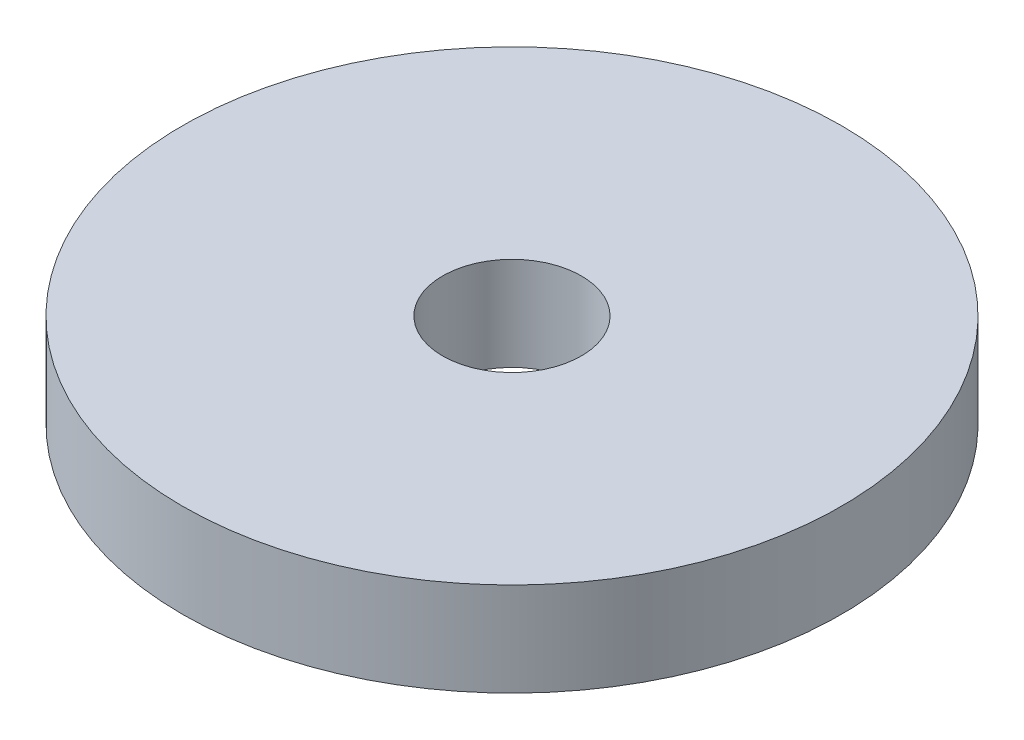
ISO-10303-21;
HEADER;
FILE_DESCRIPTION(('STEP AP214'),'2;1');
FILE_NAME('part.step','',(''),(''),'','','');
FILE_SCHEMA(('AUTOMOTIVE_DESIGN { 1 0 10303 214 1 1 1 1 }'));
ENDSEC;
DATA;
#1=APPLICATION_CONTEXT('core data for automotive mechanical design processes');
#2=APPLICATION_PROTOCOL_DEFINITION('international standard','automotive_design',2000,#1);
#3=PRODUCT_CONTEXT('',#1,'mechanical');
#4=PRODUCT('Part','Part','',(#3));
#5=PRODUCT_RELATED_PRODUCT_CATEGORY('part','',(#4));
#6=PRODUCT_DEFINITION_FORMATION('','',#4);
#7=PRODUCT_DEFINITION_CONTEXT('part definition',#1,'design');
#8=PRODUCT_DEFINITION('design','',#6,#7);
#9=PRODUCT_DEFINITION_SHAPE('','',#8);
#10=(LENGTH_UNIT() NAMED_UNIT(*) SI_UNIT(.MILLI.,.METRE.));
#11=(NAMED_UNIT(*) PLANE_ANGLE_UNIT() SI_UNIT($,.RADIAN.));
#12=(NAMED_UNIT(*) SI_UNIT($,.STERADIAN.) SOLID_ANGLE_UNIT());
#13=UNCERTAINTY_MEASURE_WITH_UNIT(LENGTH_MEASURE(1.E-05),#10,'distance_accuracy_value','');
#14=(GEOMETRIC_REPRESENTATION_CONTEXT(3) GLOBAL_UNCERTAINTY_ASSIGNED_CONTEXT((#13)) GLOBAL_UNIT_ASSIGNED_CONTEXT((#10,
#11,#12)) REPRESENTATION_CONTEXT('',''));
#15=CARTESIAN_POINT('',(0.,0.,0.));
#16=DIRECTION('',(0.,0.,1.));
#17=DIRECTION('',(1.,0.,0.));
#18=AXIS2_PLACEMENT_3D('',#15,#16,#17);
#19=CARTESIAN_POINT('',(0.,27.,0.));
#20=DIRECTION('',(0.,-1.,0.));
#21=DIRECTION('',(0.,0.,-1.));
#22=AXIS2_PLACEMENT_3D('',#19,#20,#21);
#23=CYLINDRICAL_SURFACE('',#22,95.);
#24=CARTESIAN_POINT('',(0.,27.,0.));
#25=DIRECTION('',(0.,1.,0.));
#26=DIRECTION('',(0.,0.,1.));
#27=AXIS2_PLACEMENT_3D('',#24,#25,#26);
#28=CIRCLE('',#27,95.);
#29=CARTESIAN_POINT('',(0.,27.,95.));
#30=VERTEX_POINT('',#29);
#31=EDGE_CURVE('E10',#30,#30,#28,.T.);
#32=ORIENTED_EDGE('',*,*,#31,.F.);
#33=EDGE_LOOP('',(#32));
#34=FACE_BOUND('',#33,.T.);
#35=CARTESIAN_POINT('',(0.,0.,0.));
#36=DIRECTION('',(0.,1.,0.));
#37=DIRECTION('',(0.,0.,1.));
#38=AXIS2_PLACEMENT_3D('',#35,#36,#37);
#39=CIRCLE('',#38,95.);
#40=CARTESIAN_POINT('',(0.,0.,95.));
#41=VERTEX_POINT('',#40);
#42=EDGE_CURVE('E37',#41,#41,#39,.T.);
#43=ORIENTED_EDGE('',*,*,#42,.T.);
#44=EDGE_LOOP('',(#43));
#45=FACE_BOUND('',#44,.T.);
#46=ADVANCED_FACE('F40',(#34,#45),#23,.T.);
#47=CARTESIAN_POINT('',(0.,27.,0.));
#48=DIRECTION('',(0.,1.,0.));
#49=DIRECTION('',(0.,0.,1.));
#50=AXIS2_PLACEMENT_3D('',#47,#48,#49);
#51=PLANE('',#50);
#52=CARTESIAN_POINT('',(0.,27.,0.));
#53=DIRECTION('',(0.,1.,0.));
#54=DIRECTION('',(0.,0.,1.));
#55=AXIS2_PLACEMENT_3D('',#52,#53,#54);
#56=CIRCLE('',#55,20.);
#57=CARTESIAN_POINT('',(0.,27.,20.));
#58=VERTEX_POINT('',#57);
#59=EDGE_CURVE('E50',#58,#58,#56,.T.);
#60=ORIENTED_EDGE('',*,*,#59,.F.);
#61=EDGE_LOOP('',(#60));
#62=FACE_BOUND('',#61,.T.);
#63=ORIENTED_EDGE('',*,*,#31,.T.);
#64=EDGE_LOOP('',(#63));
#65=FACE_BOUND('',#64,.T.);
#66=ADVANCED_FACE('F59',(#62,#65),#51,.T.);
#67=CARTESIAN_POINT('',(0.,0.,0.));
#68=DIRECTION('',(0.,1.,0.));
#69=DIRECTION('',(0.,0.,1.));
#70=AXIS2_PLACEMENT_3D('',#67,#68,#69);
#71=PLANE('',#70);
#72=CARTESIAN_POINT('',(0.,0.,0.));
#73=DIRECTION('',(0.,1.,0.));
#74=DIRECTION('',(0.,0.,1.));
#75=AXIS2_PLACEMENT_3D('',#72,#73,#74);
#76=CIRCLE('',#75,20.);
#77=CARTESIAN_POINT('',(0.,0.,20.));
#78=VERTEX_POINT('',#77);
#79=EDGE_CURVE('E47',#78,#78,#76,.T.);
#80=ORIENTED_EDGE('',*,*,#79,.T.);
#81=EDGE_LOOP('',(#80));
#82=FACE_BOUND('',#81,.T.);
#83=ORIENTED_EDGE('',*,*,#42,.F.);
#84=EDGE_LOOP('',(#83));
#85=FACE_BOUND('',#84,.T.);
#86=ADVANCED_FACE('F58',(#82,#85),#71,.F.);
#87=CARTESIAN_POINT('',(0.,27.,0.));
#88=DIRECTION('',(0.,-1.,0.));
#89=DIRECTION('',(0.,0.,-1.));
#90=AXIS2_PLACEMENT_3D('',#87,#88,#89);
#91=CYLINDRICAL_SURFACE('',#90,20.);
#92=ORIENTED_EDGE('',*,*,#59,.T.);
#93=EDGE_LOOP('',(#92));
#94=FACE_BOUND('',#93,.T.);
#95=ORIENTED_EDGE('',*,*,#79,.F.);
#96=EDGE_LOOP('',(#95));
#97=FACE_BOUND('',#96,.T.);
#98=ADVANCED_FACE('F54',(#94,#97),#91,.F.);
#99=CLOSED_SHELL('',(#46,#66,#86,#98));
#100=MANIFOLD_SOLID_BREP('B2',#99);
#101=ADVANCED_BREP_SHAPE_REPRESENTATION('',(#18,#100),#14);
#102=SHAPE_DEFINITION_REPRESENTATION(#9,#101);
ENDSEC;
END-ISO-10303-21;
